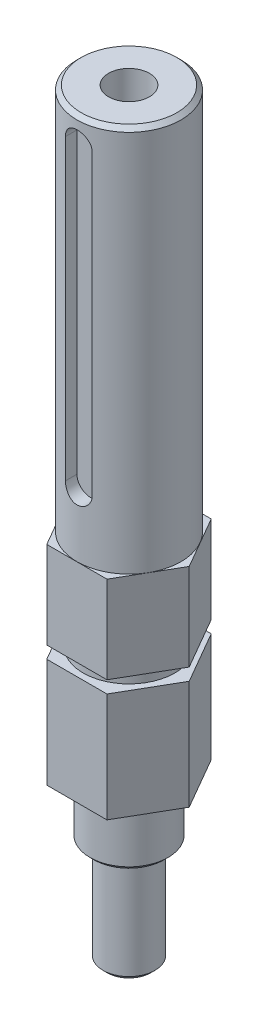
ISO-10303-21;
HEADER;
FILE_DESCRIPTION(('STEP AP214'),'2;1');
FILE_NAME('part.step','',(''),(''),'','','');
FILE_SCHEMA(('AUTOMOTIVE_DESIGN { 1 0 10303 214 1 1 1 1 }'));
ENDSEC;
DATA;
#1=APPLICATION_CONTEXT('core data for automotive mechanical design processes');
#2=APPLICATION_PROTOCOL_DEFINITION('international standard','automotive_design',2000,#1);
#3=PRODUCT_CONTEXT('',#1,'mechanical');
#4=PRODUCT('Part','Part','',(#3));
#5=PRODUCT_RELATED_PRODUCT_CATEGORY('part','',(#4));
#6=PRODUCT_DEFINITION_FORMATION('','',#4);
#7=PRODUCT_DEFINITION_CONTEXT('part definition',#1,'design');
#8=PRODUCT_DEFINITION('design','',#6,#7);
#9=PRODUCT_DEFINITION_SHAPE('','',#8);
#10=(LENGTH_UNIT() NAMED_UNIT(*) SI_UNIT(.MILLI.,.METRE.));
#11=(NAMED_UNIT(*) PLANE_ANGLE_UNIT() SI_UNIT($,.RADIAN.));
#12=(NAMED_UNIT(*) SI_UNIT($,.STERADIAN.) SOLID_ANGLE_UNIT());
#13=UNCERTAINTY_MEASURE_WITH_UNIT(LENGTH_MEASURE(1.E-05),#10,'distance_accuracy_value','');
#14=(GEOMETRIC_REPRESENTATION_CONTEXT(3) GLOBAL_UNCERTAINTY_ASSIGNED_CONTEXT((#13)) GLOBAL_UNIT_ASSIGNED_CONTEXT((#10,
#11,#12)) REPRESENTATION_CONTEXT('',''));
#15=CARTESIAN_POINT('',(0.,0.,0.));
#16=DIRECTION('',(0.,0.,1.));
#17=DIRECTION('',(1.,0.,0.));
#18=AXIS2_PLACEMENT_3D('',#15,#16,#17);
#19=CARTESIAN_POINT('',(-38.3071337234,29.7471008308,-16.6690116454));
#20=DIRECTION('',(0.,1.,0.));
#21=DIRECTION('',(-1.,0.,0.));
#22=AXIS2_PLACEMENT_3D('',#19,#20,#21);
#23=CONICAL_SURFACE('',#22,0.,1.02974425592936);
#24=CARTESIAN_POINT('',(-38.3071337234,29.7471008308,-16.6690116454));
#25=VERTEX_POINT('',#24);
#26=VERTEX_LOOP('',#25);
#27=FACE_BOUND('',#26,.T.);
#28=CARTESIAN_POINT('',(-38.3071337234,31.242,-16.6690116454));
#29=DIRECTION('',(0.,-1.,0.));
#30=DIRECTION('',(0.,0.,-1.));
#31=AXIS2_PLACEMENT_3D('',#28,#29,#30);
#32=CIRCLE('',#31,2.48793);
#33=CARTESIAN_POINT('',(-38.3071337234,31.242,-19.1569416454));
#34=VERTEX_POINT('',#33);
#35=EDGE_CURVE('E169',#34,#34,#32,.F.);
#36=ORIENTED_EDGE('',*,*,#35,.T.);
#37=EDGE_LOOP('',(#36));
#38=FACE_BOUND('',#37,.T.);
#39=ADVANCED_FACE('F17',(#27,#38),#23,.F.);
#40=CARTESIAN_POINT('',(-38.3071337234,47.117,-16.6690116454));
#41=DIRECTION('',(0.,-1.,0.));
#42=DIRECTION('',(1.,0.,0.));
#43=AXIS2_PLACEMENT_3D('',#40,#41,#42);
#44=CYLINDRICAL_SURFACE('',#43,2.48793);
#45=CARTESIAN_POINT('',(-38.3071337234,47.117,-16.6690116454));
#46=DIRECTION('',(0.,-1.,0.));
#47=DIRECTION('',(1.,0.,0.));
#48=AXIS2_PLACEMENT_3D('',#45,#46,#47);
#49=CIRCLE('',#48,2.48793);
#50=CARTESIAN_POINT('',(-35.8192037234,47.117,-16.6690116454));
#51=VERTEX_POINT('',#50);
#52=EDGE_CURVE('E20',#51,#51,#49,.F.);
#53=ORIENTED_EDGE('',*,*,#52,.T.);
#54=EDGE_LOOP('',(#53));
#55=FACE_BOUND('',#54,.T.);
#56=ORIENTED_EDGE('',*,*,#35,.F.);
#57=EDGE_LOOP('',(#56));
#58=FACE_BOUND('',#57,.T.);
#59=ADVANCED_FACE('F232',(#55,#58),#44,.F.);
#60=CARTESIAN_POINT('',(0.,0.,-11.9446116462606));
#61=DIRECTION('',(0.,0.,-1.));
#62=DIRECTION('',(-1.,0.,0.));
#63=AXIS2_PLACEMENT_3D('',#60,#61,#62);
#64=PLANE('',#63);
#65=DIRECTION('',(0.,1.,0.));
#66=VECTOR('',#65,1.);
#67=CARTESIAN_POINT('',(-36.6688337139455,0.,-11.9446116454));
#68=LINE('',#67,#66);
#69=CARTESIAN_POINT('',(-36.6688337186727,7.62,-11.9446116454));
#70=VERTEX_POINT('',#69);
#71=CARTESIAN_POINT('',(-36.6688337186727,43.942,-11.9446116454));
#72=VERTEX_POINT('',#71);
#73=EDGE_CURVE('E131',#70,#72,#68,.T.);
#74=ORIENTED_EDGE('',*,*,#73,.T.);
#75=CARTESIAN_POINT('',(-38.2944337234,43.942,-11.9446116454));
#76=DIRECTION('',(0.,0.,-1.));
#77=DIRECTION('',(-1.,0.,0.));
#78=AXIS2_PLACEMENT_3D('',#75,#76,#77);
#79=CIRCLE('',#78,1.6256);
#80=CARTESIAN_POINT('',(-39.9200337147713,43.942,-11.9446116454));
#81=VERTEX_POINT('',#80);
#82=EDGE_CURVE('E133',#72,#81,#79,.F.);
#83=ORIENTED_EDGE('',*,*,#82,.T.);
#84=DIRECTION('',(0.,1.,0.));
#85=VECTOR('',#84,1.);
#86=CARTESIAN_POINT('',(-39.9200337147713,0.,-11.9446116454));
#87=LINE('',#86,#85);
#88=CARTESIAN_POINT('',(-39.9200337190856,7.62,-11.9446116454));
#89=VERTEX_POINT('',#88);
#90=EDGE_CURVE('E136',#81,#89,#87,.F.);
#91=ORIENTED_EDGE('',*,*,#90,.T.);
#92=CARTESIAN_POINT('',(-38.2944337234,7.62,-11.9446116454));
#93=DIRECTION('',(0.,0.,-1.));
#94=DIRECTION('',(-1.,0.,0.));
#95=AXIS2_PLACEMENT_3D('',#92,#93,#94);
#96=CIRCLE('',#95,1.6256);
#97=EDGE_CURVE('E167',#89,#70,#96,.F.);
#98=ORIENTED_EDGE('',*,*,#97,.T.);
#99=EDGE_LOOP('',(#74,#83,#91,#98));
#100=FACE_BOUND('',#99,.T.);
#101=ADVANCED_FACE('F135',(#100),#64,.F.);
#102=CARTESIAN_POINT('',(0.,47.1169999982581,0.));
#103=DIRECTION('',(0.,1.,0.));
#104=DIRECTION('',(0.,0.,1.));
#105=AXIS2_PLACEMENT_3D('',#102,#103,#104);
#106=PLANE('',#105);
#107=ORIENTED_EDGE('',*,*,#52,.F.);
#108=EDGE_LOOP('',(#107));
#109=FACE_BOUND('',#108,.T.);
#110=CARTESIAN_POINT('',(-38.3071337234,47.117,-16.6690116454));
#111=DIRECTION('',(0.,-1.,0.));
#112=DIRECTION('',(1.,0.,0.));
#113=AXIS2_PLACEMENT_3D('',#110,#111,#112);
#114=CIRCLE('',#113,5.8293);
#115=CARTESIAN_POINT('',(-32.4778337234,47.117,-16.6690116454));
#116=VERTEX_POINT('',#115);
#117=EDGE_CURVE('E163',#116,#116,#114,.F.);
#118=ORIENTED_EDGE('',*,*,#117,.T.);
#119=EDGE_LOOP('',(#118));
#120=FACE_BOUND('',#119,.T.);
#121=ADVANCED_FACE('F226',(#109,#120),#106,.T.);
#122=CARTESIAN_POINT('',(-36.6688337139455,0.,0.));
#123=DIRECTION('',(1.,0.,0.));
#124=DIRECTION('',(0.,0.,-1.));
#125=AXIS2_PLACEMENT_3D('',#122,#123,#124);
#126=PLANE('',#125);
#127=ORIENTED_EDGE('',*,*,#73,.F.);
#128=DIRECTION('',(0.,0.,-1.));
#129=VECTOR('',#128,1.);
#130=CARTESIAN_POINT('',(-36.6688337234,7.62,-11.13470463047));
#131=LINE('',#130,#129);
#132=CARTESIAN_POINT('',(-36.6688337231593,7.62,-10.547137389977));
#133=VERTEX_POINT('',#132);
#134=EDGE_CURVE('E164',#70,#133,#131,.F.);
#135=ORIENTED_EDGE('',*,*,#134,.T.);
#136=DIRECTION('',(0.,1.,0.));
#137=VECTOR('',#136,1.);
#138=CARTESIAN_POINT('',(-36.6688337229187,23.3044999997243,-10.5471373900414));
#139=LINE('',#138,#137);
#140=CARTESIAN_POINT('',(-36.6688337232797,43.942,-10.547137389977));
#141=VERTEX_POINT('',#140);
#142=EDGE_CURVE('E160',#133,#141,#139,.T.);
#143=ORIENTED_EDGE('',*,*,#142,.T.);
#144=DIRECTION('',(0.,0.,1.));
#145=VECTOR('',#144,1.);
#146=CARTESIAN_POINT('',(-36.6688337234,43.942,-11.13726408306));
#147=LINE('',#146,#145);
#148=EDGE_CURVE('E143',#141,#72,#147,.F.);
#149=ORIENTED_EDGE('',*,*,#148,.T.);
#150=EDGE_LOOP('',(#127,#135,#143,#149));
#151=FACE_BOUND('',#150,.T.);
#152=ADVANCED_FACE('F223',(#151),#126,.F.);
#153=CARTESIAN_POINT('',(-38.2944337234,43.942,-10.32991652072));
#154=DIRECTION('',(0.,0.,-1.));
#155=DIRECTION('',(-1.,0.,0.));
#156=AXIS2_PLACEMENT_3D('',#153,#154,#155);
#157=CYLINDRICAL_SURFACE('',#156,1.6256);
#158=ORIENTED_EDGE('',*,*,#82,.F.);
#159=ORIENTED_EDGE('',*,*,#148,.F.);
#160=CARTESIAN_POINT('',(-36.6688337234194,43.942,-10.5471373899274));
#161=CARTESIAN_POINT('',(-36.6688331173559,43.9869132230824,-10.547140517418));
#162=CARTESIAN_POINT('',(-36.6706962528814,44.0318041382568,-10.5466386378901));
#163=CARTESIAN_POINT('',(-36.6781230875761,44.1212492173034,-10.5446571785954));
#164=CARTESIAN_POINT('',(-36.6836861333578,44.1658034392294,-10.5431777714557));
#165=CARTESIAN_POINT('',(-36.7058421910156,44.2982863146673,-10.5373329327794));
#166=CARTESIAN_POINT('',(-36.7279024963413,44.3853029336759,-10.5315605066644));
#167=CARTESIAN_POINT('',(-36.7858817424652,44.5542370706868,-10.5169351675073));
#168=CARTESIAN_POINT('',(-36.8217990686848,44.6361551814611,-10.5080826133642));
#169=CARTESIAN_POINT('',(-36.9064250978287,44.7928436735645,-10.4882941365168));
#170=CARTESIAN_POINT('',(-36.9551372097855,44.867612142696,-10.4773576587871));
#171=CARTESIAN_POINT('',(-37.0651738517186,45.0095820479997,-10.4543415813472));
#172=CARTESIAN_POINT('',(-37.126741428698,45.076591939617,-10.4422428205371));
#173=CARTESIAN_POINT('',(-37.2602380553349,45.1994763787339,-10.4184140217307));
#174=CARTESIAN_POINT('',(-37.3321706492424,45.2553471016266,-10.4066841115386));
#175=CARTESIAN_POINT('',(-37.4857159674889,45.3551763939344,-10.3846861458513));
#176=CARTESIAN_POINT('',(-37.5674620930751,45.3989357266696,-10.3744437245005));
#177=CARTESIAN_POINT('',(-37.7374052114194,45.4719765769247,-10.3567974034995));
#178=CARTESIAN_POINT('',(-37.8255948382402,45.501274337986,-10.3493903212467));
#179=CARTESIAN_POINT('',(-37.9796470482116,45.538188823147,-10.3398530504953));
#180=CARTESIAN_POINT('',(-38.0445631663894,45.5496298469016,-10.3368153435175));
#181=CARTESIAN_POINT('',(-38.175366207094,45.5645692395449,-10.3327438476344));
#182=CARTESIAN_POINT('',(-38.2412531066985,45.5680677956719,-10.3317100114894));
#183=CARTESIAN_POINT('',(-38.3968632247955,45.5668456823664,-10.3317138707887));
#184=CARTESIAN_POINT('',(-38.4865810710791,45.5586911719247,-10.3336369430375));
#185=CARTESIAN_POINT('',(-38.663343997131,45.5277322551274,-10.3411104639902));
#186=CARTESIAN_POINT('',(-38.7503866712589,45.5049150452558,-10.3466640829726));
#187=CARTESIAN_POINT('',(-38.9191932627246,45.4454120700701,-10.3607693277049));
#188=CARTESIAN_POINT('',(-39.0009642962698,45.4087454793147,-10.3693168072516));
#189=CARTESIAN_POINT('',(-39.1571958623636,45.3226431180772,-10.3884886613185));
#190=CARTESIAN_POINT('',(-39.2316564338337,45.2732074155839,-10.3991130247802));
#191=CARTESIAN_POINT('',(-39.372762747103,45.1618424885016,-10.4215310132768));
#192=CARTESIAN_POINT('',(-39.4392291699007,45.0996898042315,-10.4333433012731));
#193=CARTESIAN_POINT('',(-39.5609194002448,44.9651414098663,-10.4566658334685));
#194=CARTESIAN_POINT('',(-39.6161412925491,44.8927439583687,-10.4681760259222));
#195=CARTESIAN_POINT('',(-39.7145841132475,44.7384018165983,-10.4897688249227));
#196=CARTESIAN_POINT('',(-39.7576071086709,44.6563272570381,-10.4998267140666));
#197=CARTESIAN_POINT('',(-39.8291494859297,44.4858309684898,-10.5170848813646));
#198=CARTESIAN_POINT('',(-39.8576806278726,44.3974144527001,-10.524287475539));
#199=CARTESIAN_POINT('',(-39.8922738555966,44.2473749206176,-10.5331412325644));
#200=CARTESIAN_POINT('',(-39.9026692188615,44.186778719604,-10.5358455499993));
#201=CARTESIAN_POINT('',(-39.9165523690499,44.0647992337828,-10.539480069641));
#202=CARTESIAN_POINT('',(-39.9200458220733,44.0034166362711,-10.5404117270837));
#203=CARTESIAN_POINT('',(-39.9200337234,43.942,-10.5403963956066));
#204=B_SPLINE_CURVE_WITH_KNOTS('',3,(#160,#161,#162,#163,#164,#165,#166,#167,#168,#169,#170,
#171,#172,#173,#174,#175,#176,#177,#178,#179,#180,#181,#182,#183,#184,#185,#186,#187,#188,#189,
#190,#191,#192,#193,#194,#195,#196,#197,#198,#199,#200,#201,#202,#203),.UNSPECIFIED.,.F.,.F.,(4,
2,2,2,2,2,2,2,2,2,2,2,2,2,2,2,2,2,2,2,2,4),(0.,0.134654383448392,0.269284993846275,
0.53775345421134,0.80619064287798,1.0746994264121,1.34883846582806,1.623071468742,
1.9015786983701,2.17977238690593,2.37724591456429,2.57471478687525,2.84366769523774,
3.11285577385061,3.38167251784997,3.65048783056947,3.92451030631548,4.19857941639574,
4.47686962487167,4.75493363919668,4.93916434492229,5.12324374412517),.UNSPECIFIED.);
#205=CARTESIAN_POINT('',(-39.9200337192497,43.942,-10.5403963945144));
#206=VERTEX_POINT('',#205);
#207=EDGE_CURVE('E153',#141,#206,#204,.T.);
#208=ORIENTED_EDGE('',*,*,#207,.T.);
#209=DIRECTION('',(0.,0.,1.));
#210=VECTOR('',#209,1.);
#211=CARTESIAN_POINT('',(-39.9200337147713,43.942,0.));
#212=LINE('',#211,#210);
#213=EDGE_CURVE('E142',#206,#81,#212,.F.);
#214=ORIENTED_EDGE('',*,*,#213,.T.);
#215=EDGE_LOOP('',(#158,#159,#208,#214));
#216=FACE_BOUND('',#215,.T.);
#217=ADVANCED_FACE('F152',(#216),#157,.F.);
#218=CARTESIAN_POINT('',(-39.9200337147713,0.,0.));
#219=DIRECTION('',(-1.,0.,0.));
#220=DIRECTION('',(0.,0.,1.));
#221=AXIS2_PLACEMENT_3D('',#218,#219,#220);
#222=PLANE('',#221);
#223=ORIENTED_EDGE('',*,*,#90,.F.);
#224=ORIENTED_EDGE('',*,*,#213,.F.);
#225=DIRECTION('',(0.,-1.,0.));
#226=VECTOR('',#225,1.);
#227=CARTESIAN_POINT('',(-39.9200337237282,23.3044999997243,-10.540396395693));
#228=LINE('',#227,#226);
#229=CARTESIAN_POINT('',(-39.920033723482,7.62,-10.5403963956498));
#230=VERTEX_POINT('',#229);
#231=EDGE_CURVE('E157',#206,#230,#228,.T.);
#232=ORIENTED_EDGE('',*,*,#231,.T.);
#233=DIRECTION('',(0.,0.,1.));
#234=VECTOR('',#233,1.);
#235=CARTESIAN_POINT('',(-39.9200337234,7.62,-11.13470463047));
#236=LINE('',#235,#234);
#237=EDGE_CURVE('E149',#230,#89,#236,.F.);
#238=ORIENTED_EDGE('',*,*,#237,.T.);
#239=EDGE_LOOP('',(#223,#224,#232,#238));
#240=FACE_BOUND('',#239,.T.);
#241=ADVANCED_FACE('F146',(#240),#222,.F.);
#242=CARTESIAN_POINT('',(-38.2944337234,7.62,-10.32479761554));
#243=DIRECTION('',(0.,0.,-1.));
#244=DIRECTION('',(-1.,0.,0.));
#245=AXIS2_PLACEMENT_3D('',#242,#243,#244);
#246=CYLINDRICAL_SURFACE('',#245,1.6256);
#247=ORIENTED_EDGE('',*,*,#97,.F.);
#248=ORIENTED_EDGE('',*,*,#237,.F.);
#249=CARTESIAN_POINT('',(-39.9200337233858,7.62,-10.5403963956176));
#250=CARTESIAN_POINT('',(-39.9200343027389,7.57505716408372,-10.5403995109041));
#251=CARTESIAN_POINT('',(-39.9181687382391,7.5301366299133,-10.5399052645826));
#252=CARTESIAN_POINT('',(-39.9107320376266,7.44063211986704,-10.5379541722975));
#253=CARTESIAN_POINT('',(-39.90516154366,7.39604808702213,-10.5364974931452));
#254=CARTESIAN_POINT('',(-39.8829748012874,7.26347234177431,-10.5307428758463));
#255=CARTESIAN_POINT('',(-39.8608829271479,7.17639263153677,-10.5250599881469));
#256=CARTESIAN_POINT('',(-39.8028156693581,7.00733333292107,-10.5106686050908));
#257=CARTESIAN_POINT('',(-39.7668416560501,6.92535324207329,-10.5019604083787));
#258=CARTESIAN_POINT('',(-39.6820765888974,6.76855139505806,-10.4825111660349));
#259=CARTESIAN_POINT('',(-39.6332823592317,6.6937314188665,-10.4717696168862));
#260=CARTESIAN_POINT('',(-39.5230890235054,6.55171892478943,-10.4492011374638));
#261=CARTESIAN_POINT('',(-39.4614535617753,6.48471266381142,-10.4373565647526));
#262=CARTESIAN_POINT('',(-39.3278117109779,6.3618482106432,-10.414079137073));
#263=CARTESIAN_POINT('',(-39.2558014693683,6.30599417815495,-10.4026464370283));
#264=CARTESIAN_POINT('',(-39.102169511402,6.20626390714197,-10.3812944786169));
#265=CARTESIAN_POINT('',(-39.0204220511849,6.16257584053741,-10.3713999422531));
#266=CARTESIAN_POINT('',(-38.8505070948641,6.08967931033348,-10.3544749739849));
#267=CARTESIAN_POINT('',(-38.7623479754394,6.06045233002869,-10.3474408814913));
#268=CARTESIAN_POINT('',(-38.6125889857612,6.02465318656142,-10.3387931989957));
#269=CARTESIAN_POINT('',(-38.5520450794807,6.01376614388771,-10.3361518728947));
#270=CARTESIAN_POINT('',(-38.4300631321595,5.99890320356431,-10.3326102582362));
#271=CARTESIAN_POINT('',(-38.3686251007001,5.99492723191277,-10.3317099510363));
#272=CARTESIAN_POINT('',(-38.2174572045331,5.99375306599012,-10.331714116391));
#273=CARTESIAN_POINT('',(-38.1276672291049,6.00049685328776,-10.3336349748622));
#274=CARTESIAN_POINT('',(-37.9505200722018,6.02866100542893,-10.3411303116834));
#275=CARTESIAN_POINT('',(-37.8631654614231,6.05009630998462,-10.3467085089077));
#276=CARTESIAN_POINT('',(-37.6935203490939,6.10690149564915,-10.3609146991124));
#277=CARTESIAN_POINT('',(-37.611222771011,6.14225136726778,-10.3695383108886));
#278=CARTESIAN_POINT('',(-37.4537383131801,6.22581359902913,-10.3889327241843));
#279=CARTESIAN_POINT('',(-37.3785512227097,6.27402557783574,-10.3997034620433));
#280=CARTESIAN_POINT('',(-37.2357850276218,6.3830437277691,-10.4224993385844));
#281=CARTESIAN_POINT('',(-37.1683821300026,6.4440764016433,-10.4345447839602));
#282=CARTESIAN_POINT('',(-37.0446421659605,6.57653837651597,-10.4584185835418));
#283=CARTESIAN_POINT('',(-36.9883068903511,6.64796935677843,-10.4702469023347));
#284=CARTESIAN_POINT('',(-36.8873974787592,6.80064853891512,-10.4925689777037));
#285=CARTESIAN_POINT('',(-36.8430345867707,6.88204028811097,-10.503037259633));
#286=CARTESIAN_POINT('',(-36.7687106331166,7.0514205033058,-10.5211586235514));
#287=CARTESIAN_POINT('',(-36.7387391568963,7.13940414552119,-10.5288137403836));
#288=CARTESIAN_POINT('',(-36.7006780536368,7.29313763533453,-10.5386818176718));
#289=CARTESIAN_POINT('',(-36.6887585130561,7.35790494935085,-10.5418302716095));
#290=CARTESIAN_POINT('',(-36.6728292663508,7.48843609244857,-10.5460681139886));
#291=CARTESIAN_POINT('',(-36.6688155270224,7.55419939615339,-10.5471585523304));
#292=CARTESIAN_POINT('',(-36.6688337234,7.61999999997463,-10.5471373899126));
#293=B_SPLINE_CURVE_WITH_KNOTS('',3,(#249,#250,#251,#252,#253,#254,#255,#256,#257,#258,#259,
#260,#261,#262,#263,#264,#265,#266,#267,#268,#269,#270,#271,#272,#273,#274,#275,#276,#277,#278,
#279,#280,#281,#282,#283,#284,#285,#286,#287,#288,#289,#290,#291,#292),.UNSPECIFIED.,.F.,.F.,(4,
2,2,2,2,2,2,2,2,2,2,2,2,2,2,2,2,2,2,2,2,4),(0.,0.134743234090036,0.269463120285456,
0.538120205092799,0.806750776834311,1.07544795652383,1.34961447058744,1.62388305655983,
1.90218397172397,2.18012760813987,2.36445257689152,2.5487755719299,2.8175847166687,
3.08666761810411,3.35536497709605,3.62405437062664,3.89796436932799,4.17191865202263,
4.45043032810088,4.72874015030962,4.9260423662726,5.12324390093237),.UNSPECIFIED.);
#294=EDGE_CURVE('E197',#230,#133,#293,.T.);
#295=ORIENTED_EDGE('',*,*,#294,.T.);
#296=ORIENTED_EDGE('',*,*,#134,.F.);
#297=EDGE_LOOP('',(#247,#248,#295,#296));
#298=FACE_BOUND('',#297,.T.);
#299=ADVANCED_FACE('F213',(#298),#246,.F.);
#300=CARTESIAN_POINT('',(-38.3071337234,47.117,-16.6690116454));
#301=DIRECTION('',(0.,-1.,0.));
#302=DIRECTION('',(1.,0.,0.));
#303=AXIS2_PLACEMENT_3D('',#300,#301,#302);
#304=CONICAL_SURFACE('',#303,5.8293,0.785398163397447);
#305=ORIENTED_EDGE('',*,*,#117,.F.);
#306=EDGE_LOOP('',(#305));
#307=FACE_BOUND('',#306,.T.);
#308=CARTESIAN_POINT('',(-38.3071337234,46.609,-16.6690116454));
#309=DIRECTION('',(0.,-1.,0.));
#310=DIRECTION('',(0.,0.,1.));
#311=AXIS2_PLACEMENT_3D('',#308,#309,#310);
#312=CIRCLE('',#311,6.3373);
#313=CARTESIAN_POINT('',(-38.3071337234,46.609,-10.3317116454));
#314=VERTEX_POINT('',#313);
#315=EDGE_CURVE('E196',#314,#314,#312,.F.);
#316=ORIENTED_EDGE('',*,*,#315,.T.);
#317=EDGE_LOOP('',(#316));
#318=FACE_BOUND('',#317,.T.);
#319=ADVANCED_FACE('F217',(#307,#318),#304,.T.);
#320=CARTESIAN_POINT('',(-38.3071337234,46.609,-16.6690116454));
#321=DIRECTION('',(0.,-1.,0.));
#322=DIRECTION('',(0.,0.,-1.));
#323=AXIS2_PLACEMENT_3D('',#320,#321,#322);
#324=CYLINDRICAL_SURFACE('',#323,6.3373);
#325=CARTESIAN_POINT('',(-38.3071337234,0.,-16.6690116454));
#326=DIRECTION('',(0.,-1.,0.));
#327=DIRECTION('',(0.,0.,-1.));
#328=AXIS2_PLACEMENT_3D('',#325,#326,#327);
#329=CIRCLE('',#328,6.3373);
#330=CARTESIAN_POINT('',(-38.3071337234,0.,-23.0063116454));
#331=VERTEX_POINT('',#330);
#332=EDGE_CURVE('E192',#331,#331,#329,.F.);
#333=ORIENTED_EDGE('',*,*,#332,.T.);
#334=EDGE_LOOP('',(#333));
#335=FACE_BOUND('',#334,.T.);
#336=ORIENTED_EDGE('',*,*,#315,.F.);
#337=EDGE_LOOP('',(#336));
#338=FACE_BOUND('',#337,.T.);
#339=ORIENTED_EDGE('',*,*,#142,.F.);
#340=ORIENTED_EDGE('',*,*,#294,.F.);
#341=ORIENTED_EDGE('',*,*,#231,.F.);
#342=ORIENTED_EDGE('',*,*,#207,.F.);
#343=EDGE_LOOP('',(#339,#340,#341,#342));
#344=FACE_BOUND('',#343,.T.);
#345=ADVANCED_FACE('F209',(#335,#338,#344),#324,.T.);
#346=CARTESIAN_POINT('',(0.,0.,0.));
#347=DIRECTION('',(0.,-1.,0.));
#348=DIRECTION('',(0.,0.,-1.));
#349=AXIS2_PLACEMENT_3D('',#346,#347,#348);
#350=PLANE('',#349);
#351=ORIENTED_EDGE('',*,*,#332,.F.);
#352=EDGE_LOOP('',(#351));
#353=FACE_BOUND('',#352,.T.);
#354=DIRECTION('',(0.499999999976173,0.,-0.866025403798195));
#355=VECTOR('',#354,1.);
#356=CARTESIAN_POINT('',(-30.4489827407465,0.,-17.5797283808033));
#357=LINE('',#356,#355);
#358=CARTESIAN_POINT('',(-34.6409594973203,0.,-10.3190116461587));
#359=VERTEX_POINT('',#358);
#360=CARTESIAN_POINT('',(-30.9747852942441,0.,-16.669011644907));
#361=VERTEX_POINT('',#360);
#362=EDGE_CURVE('E195',#359,#361,#357,.T.);
#363=ORIENTED_EDGE('',*,*,#362,.T.);
#364=DIRECTION('',(-0.499999999976173,0.,-0.866025403798195));
#365=VECTOR('',#364,1.);
#366=CARTESIAN_POINT('',(-16.0131952027159,0.,9.24522256028665));
#367=LINE('',#366,#365);
#368=CARTESIAN_POINT('',(-34.6409594996435,0.,-23.0190116435238));
#369=VERTEX_POINT('',#368);
#370=EDGE_CURVE('E344',#361,#369,#367,.T.);
#371=ORIENTED_EDGE('',*,*,#370,.T.);
#372=DIRECTION('',(-1.,0.,0.));
#373=VECTOR('',#372,1.);
#374=CARTESIAN_POINT('',(0.,0.,-23.0190116458477));
#375=LINE('',#374,#373);
#376=CARTESIAN_POINT('',(-41.9733079243032,0.,-23.0190116451061));
#377=VERTEX_POINT('',#376);
#378=EDGE_CURVE('E577',#369,#377,#375,.T.);
#379=ORIENTED_EDGE('',*,*,#378,.T.);
#380=DIRECTION('',(-0.499999999976173,0.,0.866025403798195));
#381=VECTOR('',#380,1.);
#382=CARTESIAN_POINT('',(-41.4475053684594,0.,-23.929728380198));
#383=LINE('',#382,#381);
#384=CARTESIAN_POINT('',(-45.6394821290293,0.,-16.6690116453275));
#385=VERTEX_POINT('',#384);
#386=EDGE_CURVE('E582',#377,#385,#383,.T.);
#387=ORIENTED_EDGE('',*,*,#386,.T.);
#388=DIRECTION('',(0.499999999976173,0.,0.866025403798195));
#389=VECTOR('',#388,1.);
#390=CARTESIAN_POINT('',(-27.0117178304289,0.,15.5952225596814));
#391=LINE('',#390,#389);
#392=CARTESIAN_POINT('',(-41.9733079246094,0.,-10.3190116458529));
#393=VERTEX_POINT('',#392);
#394=EDGE_CURVE('E587',#385,#393,#391,.T.);
#395=ORIENTED_EDGE('',*,*,#394,.T.);
#396=DIRECTION('',(1.,0.,0.));
#397=VECTOR('',#396,1.);
#398=CARTESIAN_POINT('',(0.,0.,-10.3190116458477));
#399=LINE('',#398,#397);
#400=EDGE_CURVE('E347',#393,#359,#399,.T.);
#401=ORIENTED_EDGE('',*,*,#400,.T.);
#402=EDGE_LOOP('',(#363,#371,#379,#387,#395,#401));
#403=FACE_BOUND('',#402,.T.);
#404=ADVANCED_FACE('F332',(#353,#403),#350,.F.);
#405=CARTESIAN_POINT('',(-30.4489827407465,0.,-17.5797283808033));
#406=DIRECTION('',(0.866025403798195,0.,0.499999999976173));
#407=DIRECTION('',(0.499999999976173,0.,-0.866025403798195));
#408=AXIS2_PLACEMENT_3D('',#405,#406,#407);
#409=PLANE('',#408);
#410=DIRECTION('',(0.,1.,0.));
#411=VECTOR('',#410,1.);
#412=CARTESIAN_POINT('',(-30.9747852957961,0.,-16.6690116445939));
#413=LINE('',#412,#411);
#414=CARTESIAN_POINT('',(-30.9747852942441,-10.6171999994645,-16.669011644907));
#415=VERTEX_POINT('',#414);
#416=EDGE_CURVE('E351',#415,#361,#413,.T.);
#417=ORIENTED_EDGE('',*,*,#416,.T.);
#418=ORIENTED_EDGE('',*,*,#362,.F.);
#419=DIRECTION('',(0.,1.,0.));
#420=VECTOR('',#419,1.);
#421=CARTESIAN_POINT('',(-34.6409594962,0.,-10.3190116458477));
#422=LINE('',#421,#420);
#423=CARTESIAN_POINT('',(-34.6409594984406,-10.6171999994645,-10.3190116468055));
#424=VERTEX_POINT('',#423);
#425=EDGE_CURVE('E593',#359,#424,#422,.F.);
#426=ORIENTED_EDGE('',*,*,#425,.T.);
#427=DIRECTION('',(0.499999999227316,0.,-0.866025404230548));
#428=VECTOR('',#427,1.);
#429=CARTESIAN_POINT('',(-34.6409594962,-10.6171999978581,-10.3190116454));
#430=LINE('',#429,#428);
#431=EDGE_CURVE('E359',#424,#415,#430,.T.);
#432=ORIENTED_EDGE('',*,*,#431,.T.);
#433=EDGE_LOOP('',(#417,#418,#426,#432));
#434=FACE_BOUND('',#433,.T.);
#435=ADVANCED_FACE('F329',(#434),#409,.T.);
#436=CARTESIAN_POINT('',(-16.0131952027159,0.,9.24522256028665));
#437=DIRECTION('',(0.866025403798195,0.,-0.499999999976173));
#438=DIRECTION('',(-0.499999999976173,0.,-0.866025403798195));
#439=AXIS2_PLACEMENT_3D('',#436,#437,#438);
#440=PLANE('',#439);
#441=DIRECTION('',(0.,1.,0.));
#442=VECTOR('',#441,1.);
#443=CARTESIAN_POINT('',(-34.6409594962,0.,-23.0190116458477));
#444=LINE('',#443,#442);
#445=CARTESIAN_POINT('',(-34.6409594996435,-10.6171999994645,-23.0190116435238));
#446=VERTEX_POINT('',#445);
#447=EDGE_CURVE('E356',#446,#369,#444,.T.);
#448=ORIENTED_EDGE('',*,*,#447,.T.);
#449=ORIENTED_EDGE('',*,*,#370,.F.);
#450=ORIENTED_EDGE('',*,*,#416,.F.);
#451=DIRECTION('',(-0.499999999227316,0.,-0.866025404230548));
#452=VECTOR('',#451,1.);
#453=CARTESIAN_POINT('',(-30.9747852944,-10.6171999978581,-16.6690116454));
#454=LINE('',#453,#452);
#455=EDGE_CURVE('E596',#415,#446,#454,.T.);
#456=ORIENTED_EDGE('',*,*,#455,.T.);
#457=EDGE_LOOP('',(#448,#449,#450,#456));
#458=FACE_BOUND('',#457,.T.);
#459=ADVANCED_FACE('F325',(#458),#440,.T.);
#460=CARTESIAN_POINT('',(0.,0.,-23.0190116458477));
#461=DIRECTION('',(0.,0.,-1.));
#462=DIRECTION('',(-1.,0.,0.));
#463=AXIS2_PLACEMENT_3D('',#460,#461,#462);
#464=PLANE('',#463);
#465=DIRECTION('',(0.,1.,0.));
#466=VECTOR('',#465,1.);
#467=CARTESIAN_POINT('',(-41.9733079216129,0.,-23.019011643329));
#468=LINE('',#467,#466);
#469=CARTESIAN_POINT('',(-41.9733079243032,-10.6171999994645,-23.0190116451061));
#470=VERTEX_POINT('',#469);
#471=EDGE_CURVE('E579',#470,#377,#468,.T.);
#472=ORIENTED_EDGE('',*,*,#471,.T.);
#473=ORIENTED_EDGE('',*,*,#378,.F.);
#474=ORIENTED_EDGE('',*,*,#447,.F.);
#475=DIRECTION('',(1.,0.,0.));
#476=VECTOR('',#475,1.);
#477=CARTESIAN_POINT('',(0.,-10.6171999978581,-23.0190116454));
#478=LINE('',#477,#476);
#479=EDGE_CURVE('E598',#446,#470,#478,.F.);
#480=ORIENTED_EDGE('',*,*,#479,.T.);
#481=EDGE_LOOP('',(#472,#473,#474,#480));
#482=FACE_BOUND('',#481,.T.);
#483=ADVANCED_FACE('F321',(#482),#464,.T.);
#484=CARTESIAN_POINT('',(-41.4475053684594,0.,-23.929728380198));
#485=DIRECTION('',(-0.866025403798195,0.,-0.499999999976173));
#486=DIRECTION('',(-0.499999999976173,0.,0.866025403798195));
#487=AXIS2_PLACEMENT_3D('',#484,#485,#486);
#488=PLANE('',#487);
#489=DIRECTION('',(0.,1.,0.));
#490=VECTOR('',#489,1.);
#491=CARTESIAN_POINT('',(-45.6394821313097,0.,-16.6690116429118));
#492=LINE('',#491,#490);
#493=CARTESIAN_POINT('',(-45.6394821290293,-10.6171999994645,-16.6690116453275));
#494=VERTEX_POINT('',#493);
#495=EDGE_CURVE('E584',#494,#385,#492,.T.);
#496=ORIENTED_EDGE('',*,*,#495,.T.);
#497=ORIENTED_EDGE('',*,*,#386,.F.);
#498=ORIENTED_EDGE('',*,*,#471,.F.);
#499=DIRECTION('',(-0.499999999227316,0.,0.866025404230548));
#500=VECTOR('',#499,1.);
#501=CARTESIAN_POINT('',(-41.9733079252,-10.6171999978581,-23.0190116454));
#502=LINE('',#501,#500);
#503=EDGE_CURVE('E601',#470,#494,#502,.T.);
#504=ORIENTED_EDGE('',*,*,#503,.T.);
#505=EDGE_LOOP('',(#496,#497,#498,#504));
#506=FACE_BOUND('',#505,.T.);
#507=ADVANCED_FACE('F317',(#506),#488,.T.);
#508=CARTESIAN_POINT('',(-27.0117178304289,0.,15.5952225596814));
#509=DIRECTION('',(-0.866025403798195,0.,0.499999999976173));
#510=DIRECTION('',(0.499999999976173,0.,0.866025403798195));
#511=AXIS2_PLACEMENT_3D('',#508,#509,#510);
#512=PLANE('',#511);
#513=DIRECTION('',(0.,1.,0.));
#514=VECTOR('',#513,1.);
#515=CARTESIAN_POINT('',(-41.9733079252,0.,-10.3190116458477));
#516=LINE('',#515,#514);
#517=CARTESIAN_POINT('',(-41.9733079246094,-10.6171999994645,-10.3190116458529));
#518=VERTEX_POINT('',#517);
#519=EDGE_CURVE('E589',#518,#393,#516,.T.);
#520=ORIENTED_EDGE('',*,*,#519,.T.);
#521=ORIENTED_EDGE('',*,*,#394,.F.);
#522=ORIENTED_EDGE('',*,*,#495,.F.);
#523=DIRECTION('',(0.499999999227316,0.,0.866025404230548));
#524=VECTOR('',#523,1.);
#525=CARTESIAN_POINT('',(-45.639482127,-10.6171999978581,-16.6690116454));
#526=LINE('',#525,#524);
#527=EDGE_CURVE('E604',#494,#518,#526,.T.);
#528=ORIENTED_EDGE('',*,*,#527,.T.);
#529=EDGE_LOOP('',(#520,#521,#522,#528));
#530=FACE_BOUND('',#529,.T.);
#531=ADVANCED_FACE('F313',(#530),#512,.T.);
#532=CARTESIAN_POINT('',(0.,0.,-10.3190116458477));
#533=DIRECTION('',(0.,0.,1.));
#534=DIRECTION('',(1.,0.,0.));
#535=AXIS2_PLACEMENT_3D('',#532,#533,#534);
#536=PLANE('',#535);
#537=ORIENTED_EDGE('',*,*,#425,.F.);
#538=ORIENTED_EDGE('',*,*,#400,.F.);
#539=ORIENTED_EDGE('',*,*,#519,.F.);
#540=DIRECTION('',(1.,0.,0.));
#541=VECTOR('',#540,1.);
#542=CARTESIAN_POINT('',(0.,-10.6171999978581,-10.3190116454));
#543=LINE('',#542,#541);
#544=EDGE_CURVE('E191',#518,#424,#543,.T.);
#545=ORIENTED_EDGE('',*,*,#544,.T.);
#546=EDGE_LOOP('',(#537,#538,#539,#545));
#547=FACE_BOUND('',#546,.T.);
#548=ADVANCED_FACE('F309',(#547),#536,.T.);
#549=CARTESIAN_POINT('',(0.,-10.6171999978581,0.));
#550=DIRECTION('',(0.,-1.,0.));
#551=DIRECTION('',(0.,0.,-1.));
#552=AXIS2_PLACEMENT_3D('',#549,#550,#551);
#553=PLANE('',#552);
#554=CARTESIAN_POINT('',(-38.3071337234,-10.6172,-16.6690116454));
#555=DIRECTION('',(0.,-1.,0.));
#556=DIRECTION('',(0.,0.,-1.));
#557=AXIS2_PLACEMENT_3D('',#554,#555,#556);
#558=CIRCLE('',#557,5.588);
#559=CARTESIAN_POINT('',(-38.3071337234,-10.6172,-22.2570116454));
#560=VERTEX_POINT('',#559);
#561=EDGE_CURVE('E188',#560,#560,#558,.F.);
#562=ORIENTED_EDGE('',*,*,#561,.T.);
#563=EDGE_LOOP('',(#562));
#564=FACE_BOUND('',#563,.T.);
#565=ORIENTED_EDGE('',*,*,#527,.F.);
#566=ORIENTED_EDGE('',*,*,#503,.F.);
#567=ORIENTED_EDGE('',*,*,#479,.F.);
#568=ORIENTED_EDGE('',*,*,#455,.F.);
#569=ORIENTED_EDGE('',*,*,#431,.F.);
#570=ORIENTED_EDGE('',*,*,#544,.F.);
#571=EDGE_LOOP('',(#565,#566,#567,#568,#569,#570));
#572=FACE_BOUND('',#571,.T.);
#573=ADVANCED_FACE('F305',(#564,#572),#553,.T.);
#574=CARTESIAN_POINT('',(-38.3071337234,-10.6172,-16.6690116454));
#575=DIRECTION('',(0.,-1.,0.));
#576=DIRECTION('',(0.,0.,-1.));
#577=AXIS2_PLACEMENT_3D('',#574,#575,#576);
#578=CYLINDRICAL_SURFACE('',#577,5.588);
#579=ORIENTED_EDGE('',*,*,#561,.F.);
#580=EDGE_LOOP('',(#579));
#581=FACE_BOUND('',#580,.T.);
#582=CARTESIAN_POINT('',(-38.3071337234,-12.1158,-16.6690116454));
#583=DIRECTION('',(0.,-1.,0.));
#584=DIRECTION('',(0.,0.,-1.));
#585=AXIS2_PLACEMENT_3D('',#582,#583,#584);
#586=CIRCLE('',#585,5.588);
#587=CARTESIAN_POINT('',(-38.3071337234,-12.1158,-22.2570116454));
#588=VERTEX_POINT('',#587);
#589=EDGE_CURVE('E184',#588,#588,#586,.F.);
#590=ORIENTED_EDGE('',*,*,#589,.T.);
#591=EDGE_LOOP('',(#590));
#592=FACE_BOUND('',#591,.T.);
#593=ADVANCED_FACE('F301',(#581,#592),#578,.T.);
#594=CARTESIAN_POINT('',(0.,-12.1158000006581,0.));
#595=DIRECTION('',(0.,-1.,0.));
#596=DIRECTION('',(0.,0.,-1.));
#597=AXIS2_PLACEMENT_3D('',#594,#595,#596);
#598=PLANE('',#597);
#599=ORIENTED_EDGE('',*,*,#589,.F.);
#600=EDGE_LOOP('',(#599));
#601=FACE_BOUND('',#600,.T.);
#602=DIRECTION('',(0.499999999976173,0.,-0.866025403798195));
#603=VECTOR('',#602,1.);
#604=CARTESIAN_POINT('',(-30.4489827407465,-12.1158,-17.5797283808033));
#605=LINE('',#604,#603);
#606=CARTESIAN_POINT('',(-34.6409594973203,-12.115800000329,-10.3190116461587));
#607=VERTEX_POINT('',#606);
#608=CARTESIAN_POINT('',(-30.9747852942441,-12.1158000001645,-16.669011644907));
#609=VERTEX_POINT('',#608);
#610=EDGE_CURVE('E187',#607,#609,#605,.T.);
#611=ORIENTED_EDGE('',*,*,#610,.T.);
#612=DIRECTION('',(-0.499999999976173,0.,-0.866025403798195));
#613=VECTOR('',#612,1.);
#614=CARTESIAN_POINT('',(-16.0131952027159,-12.1158,9.24522256028665));
#615=LINE('',#614,#613);
#616=CARTESIAN_POINT('',(-34.6409594996435,-12.1158000001645,-23.0190116435238));
#617=VERTEX_POINT('',#616);
#618=EDGE_CURVE('E613',#609,#617,#615,.T.);
#619=ORIENTED_EDGE('',*,*,#618,.T.);
#620=DIRECTION('',(-1.,0.,0.));
#621=VECTOR('',#620,1.);
#622=CARTESIAN_POINT('',(0.,-12.1158,-23.0190116458477));
#623=LINE('',#622,#621);
#624=CARTESIAN_POINT('',(-41.9733079243032,-12.1158000001645,-23.0190116451061));
#625=VERTEX_POINT('',#624);
#626=EDGE_CURVE('E618',#617,#625,#623,.T.);
#627=ORIENTED_EDGE('',*,*,#626,.T.);
#628=DIRECTION('',(-0.499999999976173,0.,0.866025403798195));
#629=VECTOR('',#628,1.);
#630=CARTESIAN_POINT('',(-41.4475053684594,-12.1158,-23.929728380198));
#631=LINE('',#630,#629);
#632=CARTESIAN_POINT('',(-45.6394821290293,-12.1158000001645,-16.6690116453275));
#633=VERTEX_POINT('',#632);
#634=EDGE_CURVE('E623',#625,#633,#631,.T.);
#635=ORIENTED_EDGE('',*,*,#634,.T.);
#636=DIRECTION('',(0.499999999976173,0.,0.866025403798195));
#637=VECTOR('',#636,1.);
#638=CARTESIAN_POINT('',(-27.0117178304289,-12.1158,15.5952225596814));
#639=LINE('',#638,#637);
#640=CARTESIAN_POINT('',(-41.9733079246094,-12.1158000001645,-10.3190116458529));
#641=VERTEX_POINT('',#640);
#642=EDGE_CURVE('E628',#633,#641,#639,.T.);
#643=ORIENTED_EDGE('',*,*,#642,.T.);
#644=DIRECTION('',(1.,0.,0.));
#645=VECTOR('',#644,1.);
#646=CARTESIAN_POINT('',(0.,-12.1158,-10.3190116458477));
#647=LINE('',#646,#645);
#648=EDGE_CURVE('E631',#641,#607,#647,.T.);
#649=ORIENTED_EDGE('',*,*,#648,.T.);
#650=EDGE_LOOP('',(#611,#619,#627,#635,#643,#649));
#651=FACE_BOUND('',#650,.T.);
#652=ADVANCED_FACE('F297',(#601,#651),#598,.F.);
#653=CARTESIAN_POINT('',(0.,-45.2120000018064,0.));
#654=DIRECTION('',(0.,-1.,0.));
#655=DIRECTION('',(0.,0.,-1.));
#656=AXIS2_PLACEMENT_3D('',#653,#654,#655);
#657=PLANE('',#656);
#658=CARTESIAN_POINT('',(-38.3071337234,-45.212,-16.6690116454));
#659=DIRECTION('',(0.,1.,0.));
#660=DIRECTION('',(0.,0.,1.));
#661=AXIS2_PLACEMENT_3D('',#658,#659,#660);
#662=CIRCLE('',#661,2.6543);
#663=CARTESIAN_POINT('',(-38.3071337234,-45.212,-14.0147116454));
#664=VERTEX_POINT('',#663);
#665=EDGE_CURVE('E179',#664,#664,#662,.F.);
#666=ORIENTED_EDGE('',*,*,#665,.T.);
#667=EDGE_LOOP('',(#666));
#668=FACE_BOUND('',#667,.T.);
#669=ADVANCED_FACE('F293',(#668),#657,.T.);
#670=CARTESIAN_POINT('',(-30.4489827407465,0.,-17.5797283808033));
#671=DIRECTION('',(0.866025403798195,0.,0.499999999976173));
#672=DIRECTION('',(0.499999999976173,0.,-0.866025403798195));
#673=AXIS2_PLACEMENT_3D('',#670,#671,#672);
#674=PLANE('',#673);
#675=DIRECTION('',(0.,1.,0.));
#676=VECTOR('',#675,1.);
#677=CARTESIAN_POINT('',(-30.9747852957961,0.,-16.6690116445939));
#678=LINE('',#677,#676);
#679=CARTESIAN_POINT('',(-30.9747852942441,-25.4,-16.669011644907));
#680=VERTEX_POINT('',#679);
#681=EDGE_CURVE('E610',#680,#609,#678,.T.);
#682=ORIENTED_EDGE('',*,*,#681,.T.);
#683=ORIENTED_EDGE('',*,*,#610,.F.);
#684=DIRECTION('',(0.,1.,0.));
#685=VECTOR('',#684,1.);
#686=CARTESIAN_POINT('',(-34.6409594962,0.,-10.3190116458477));
#687=LINE('',#686,#685);
#688=CARTESIAN_POINT('',(-34.6409594984406,-25.4,-10.3190116468055));
#689=VERTEX_POINT('',#688);
#690=EDGE_CURVE('E183',#607,#689,#687,.F.);
#691=ORIENTED_EDGE('',*,*,#690,.T.);
#692=DIRECTION('',(0.499999999227316,0.,-0.866025404230548));
#693=VECTOR('',#692,1.);
#694=CARTESIAN_POINT('',(-34.6409594962,-25.4,-10.3190116454));
#695=LINE('',#694,#693);
#696=EDGE_CURVE('E182',#689,#680,#695,.T.);
#697=ORIENTED_EDGE('',*,*,#696,.T.);
#698=EDGE_LOOP('',(#682,#683,#691,#697));
#699=FACE_BOUND('',#698,.T.);
#700=ADVANCED_FACE('F289',(#699),#674,.T.);
#701=CARTESIAN_POINT('',(-16.0131952027159,0.,9.24522256028665));
#702=DIRECTION('',(0.866025403798195,0.,-0.499999999976173));
#703=DIRECTION('',(-0.499999999976173,0.,-0.866025403798195));
#704=AXIS2_PLACEMENT_3D('',#701,#702,#703);
#705=PLANE('',#704);
#706=DIRECTION('',(0.,1.,0.));
#707=VECTOR('',#706,1.);
#708=CARTESIAN_POINT('',(-34.6409594962,0.,-23.0190116458477));
#709=LINE('',#708,#707);
#710=CARTESIAN_POINT('',(-34.6409594996435,-25.4,-23.0190116435238));
#711=VERTEX_POINT('',#710);
#712=EDGE_CURVE('E615',#711,#617,#709,.T.);
#713=ORIENTED_EDGE('',*,*,#712,.T.);
#714=ORIENTED_EDGE('',*,*,#618,.F.);
#715=ORIENTED_EDGE('',*,*,#681,.F.);
#716=DIRECTION('',(-0.499999999227316,0.,-0.866025404230548));
#717=VECTOR('',#716,1.);
#718=CARTESIAN_POINT('',(-30.9747852944,-25.4,-16.6690116454));
#719=LINE('',#718,#717);
#720=EDGE_CURVE('E643',#680,#711,#719,.T.);
#721=ORIENTED_EDGE('',*,*,#720,.T.);
#722=EDGE_LOOP('',(#713,#714,#715,#721));
#723=FACE_BOUND('',#722,.T.);
#724=ADVANCED_FACE('F285',(#723),#705,.T.);
#725=CARTESIAN_POINT('',(0.,0.,-23.0190116458477));
#726=DIRECTION('',(0.,0.,-1.));
#727=DIRECTION('',(-1.,0.,0.));
#728=AXIS2_PLACEMENT_3D('',#725,#726,#727);
#729=PLANE('',#728);
#730=DIRECTION('',(0.,1.,0.));
#731=VECTOR('',#730,1.);
#732=CARTESIAN_POINT('',(-41.9733079216129,0.,-23.019011643329));
#733=LINE('',#732,#731);
#734=CARTESIAN_POINT('',(-41.9733079243032,-25.4,-23.0190116451061));
#735=VERTEX_POINT('',#734);
#736=EDGE_CURVE('E620',#735,#625,#733,.T.);
#737=ORIENTED_EDGE('',*,*,#736,.T.);
#738=ORIENTED_EDGE('',*,*,#626,.F.);
#739=ORIENTED_EDGE('',*,*,#712,.F.);
#740=DIRECTION('',(1.,0.,0.));
#741=VECTOR('',#740,1.);
#742=CARTESIAN_POINT('',(0.,-25.4,-23.0190116454));
#743=LINE('',#742,#741);
#744=EDGE_CURVE('E646',#711,#735,#743,.F.);
#745=ORIENTED_EDGE('',*,*,#744,.T.);
#746=EDGE_LOOP('',(#737,#738,#739,#745));
#747=FACE_BOUND('',#746,.T.);
#748=ADVANCED_FACE('F281',(#747),#729,.T.);
#749=CARTESIAN_POINT('',(-41.4475053684594,0.,-23.929728380198));
#750=DIRECTION('',(-0.866025403798195,0.,-0.499999999976173));
#751=DIRECTION('',(-0.499999999976173,0.,0.866025403798195));
#752=AXIS2_PLACEMENT_3D('',#749,#750,#751);
#753=PLANE('',#752);
#754=DIRECTION('',(0.,1.,0.));
#755=VECTOR('',#754,1.);
#756=CARTESIAN_POINT('',(-45.6394821313097,0.,-16.6690116429118));
#757=LINE('',#756,#755);
#758=CARTESIAN_POINT('',(-45.6394821290293,-25.4,-16.6690116453275));
#759=VERTEX_POINT('',#758);
#760=EDGE_CURVE('E625',#759,#633,#757,.T.);
#761=ORIENTED_EDGE('',*,*,#760,.T.);
#762=ORIENTED_EDGE('',*,*,#634,.F.);
#763=ORIENTED_EDGE('',*,*,#736,.F.);
#764=DIRECTION('',(-0.499999999227316,0.,0.866025404230548));
#765=VECTOR('',#764,1.);
#766=CARTESIAN_POINT('',(-41.9733079252,-25.4,-23.0190116454));
#767=LINE('',#766,#765);
#768=EDGE_CURVE('E649',#735,#759,#767,.T.);
#769=ORIENTED_EDGE('',*,*,#768,.T.);
#770=EDGE_LOOP('',(#761,#762,#763,#769));
#771=FACE_BOUND('',#770,.T.);
#772=ADVANCED_FACE('F277',(#771),#753,.T.);
#773=CARTESIAN_POINT('',(-27.0117178304289,0.,15.5952225596814));
#774=DIRECTION('',(-0.866025403798195,0.,0.499999999976173));
#775=DIRECTION('',(0.499999999976173,0.,0.866025403798195));
#776=AXIS2_PLACEMENT_3D('',#773,#774,#775);
#777=PLANE('',#776);
#778=DIRECTION('',(0.,1.,0.));
#779=VECTOR('',#778,1.);
#780=CARTESIAN_POINT('',(-41.9733079252,0.,-10.3190116458477));
#781=LINE('',#780,#779);
#782=CARTESIAN_POINT('',(-41.9733079246094,-25.4,-10.3190116458529));
#783=VERTEX_POINT('',#782);
#784=EDGE_CURVE('E35',#783,#641,#781,.T.);
#785=ORIENTED_EDGE('',*,*,#784,.T.);
#786=ORIENTED_EDGE('',*,*,#642,.F.);
#787=ORIENTED_EDGE('',*,*,#760,.F.);
#788=DIRECTION('',(0.499999999227316,0.,0.866025404230548));
#789=VECTOR('',#788,1.);
#790=CARTESIAN_POINT('',(-45.639482127,-25.4,-16.6690116454));
#791=LINE('',#790,#789);
#792=EDGE_CURVE('E652',#759,#783,#791,.T.);
#793=ORIENTED_EDGE('',*,*,#792,.T.);
#794=EDGE_LOOP('',(#785,#786,#787,#793));
#795=FACE_BOUND('',#794,.T.);
#796=ADVANCED_FACE('F274',(#795),#777,.T.);
#797=CARTESIAN_POINT('',(0.,0.,-10.3190116458477));
#798=DIRECTION('',(0.,0.,1.));
#799=DIRECTION('',(1.,0.,0.));
#800=AXIS2_PLACEMENT_3D('',#797,#798,#799);
#801=PLANE('',#800);
#802=ORIENTED_EDGE('',*,*,#690,.F.);
#803=ORIENTED_EDGE('',*,*,#648,.F.);
#804=ORIENTED_EDGE('',*,*,#784,.F.);
#805=DIRECTION('',(1.,0.,0.));
#806=VECTOR('',#805,1.);
#807=CARTESIAN_POINT('',(0.,-25.4,-10.3190116454));
#808=LINE('',#807,#806);
#809=EDGE_CURVE('E638',#783,#689,#808,.T.);
#810=ORIENTED_EDGE('',*,*,#809,.T.);
#811=EDGE_LOOP('',(#802,#803,#804,#810));
#812=FACE_BOUND('',#811,.T.);
#813=ADVANCED_FACE('F270',(#812),#801,.T.);
#814=CARTESIAN_POINT('',(-38.3071337234,-45.212,-16.6690116454));
#815=DIRECTION('',(0.,1.,0.));
#816=DIRECTION('',(0.,0.,1.));
#817=AXIS2_PLACEMENT_3D('',#814,#815,#816);
#818=CONICAL_SURFACE('',#817,2.6543,0.785398163397447);
#819=CARTESIAN_POINT('',(-38.3071337234,-44.704,-16.6690116454));
#820=DIRECTION('',(0.,1.,0.));
#821=DIRECTION('',(0.,0.,1.));
#822=AXIS2_PLACEMENT_3D('',#819,#820,#821);
#823=CIRCLE('',#822,3.1623);
#824=CARTESIAN_POINT('',(-38.3071337234,-44.704,-13.5067116454));
#825=VERTEX_POINT('',#824);
#826=EDGE_CURVE('E178',#825,#825,#823,.F.);
#827=ORIENTED_EDGE('',*,*,#826,.T.);
#828=EDGE_LOOP('',(#827));
#829=FACE_BOUND('',#828,.T.);
#830=ORIENTED_EDGE('',*,*,#665,.F.);
#831=EDGE_LOOP('',(#830));
#832=FACE_BOUND('',#831,.T.);
#833=ADVANCED_FACE('F266',(#829,#832),#818,.T.);
#834=CARTESIAN_POINT('',(0.,-25.4,0.));
#835=DIRECTION('',(0.,-1.,0.));
#836=DIRECTION('',(0.,0.,-1.));
#837=AXIS2_PLACEMENT_3D('',#834,#835,#836);
#838=PLANE('',#837);
#839=CARTESIAN_POINT('',(-38.3071337234,-25.4,-16.6690116454));
#840=DIRECTION('',(0.,1.,0.));
#841=DIRECTION('',(0.,0.,1.));
#842=AXIS2_PLACEMENT_3D('',#839,#840,#841);
#843=CIRCLE('',#842,4.7498);
#844=CARTESIAN_POINT('',(-38.3071337234,-25.4,-11.9192116454));
#845=VERTEX_POINT('',#844);
#846=EDGE_CURVE('E175',#845,#845,#843,.T.);
#847=ORIENTED_EDGE('',*,*,#846,.T.);
#848=EDGE_LOOP('',(#847));
#849=FACE_BOUND('',#848,.T.);
#850=ORIENTED_EDGE('',*,*,#792,.F.);
#851=ORIENTED_EDGE('',*,*,#768,.F.);
#852=ORIENTED_EDGE('',*,*,#744,.F.);
#853=ORIENTED_EDGE('',*,*,#720,.F.);
#854=ORIENTED_EDGE('',*,*,#696,.F.);
#855=ORIENTED_EDGE('',*,*,#809,.F.);
#856=EDGE_LOOP('',(#850,#851,#852,#853,#854,#855));
#857=FACE_BOUND('',#856,.T.);
#858=ADVANCED_FACE('F262',(#849,#857),#838,.T.);
#859=CARTESIAN_POINT('',(-38.3071337234,-44.704,-16.6690116454));
#860=DIRECTION('',(0.,1.,0.));
#861=DIRECTION('',(0.,0.,1.));
#862=AXIS2_PLACEMENT_3D('',#859,#860,#861);
#863=CYLINDRICAL_SURFACE('',#862,3.1623);
#864=CARTESIAN_POINT('',(-38.3071337234,-32.512,-16.6690116454));
#865=DIRECTION('',(0.,1.,0.));
#866=DIRECTION('',(0.,0.,1.));
#867=AXIS2_PLACEMENT_3D('',#864,#865,#866);
#868=CIRCLE('',#867,3.1623);
#869=CARTESIAN_POINT('',(-38.3071337234,-32.512,-13.5067116454));
#870=VERTEX_POINT('',#869);
#871=EDGE_CURVE('E172',#870,#870,#868,.F.);
#872=ORIENTED_EDGE('',*,*,#871,.T.);
#873=EDGE_LOOP('',(#872));
#874=FACE_BOUND('',#873,.T.);
#875=ORIENTED_EDGE('',*,*,#826,.F.);
#876=EDGE_LOOP('',(#875));
#877=FACE_BOUND('',#876,.T.);
#878=ADVANCED_FACE('F258',(#874,#877),#863,.T.);
#879=CARTESIAN_POINT('',(-38.3071337234,-32.004,-16.6690116454));
#880=DIRECTION('',(0.,1.,0.));
#881=DIRECTION('',(0.,0.,1.));
#882=AXIS2_PLACEMENT_3D('',#879,#880,#881);
#883=CYLINDRICAL_SURFACE('',#882,4.7498);
#884=ORIENTED_EDGE('',*,*,#846,.F.);
#885=EDGE_LOOP('',(#884));
#886=FACE_BOUND('',#885,.T.);
#887=CARTESIAN_POINT('',(-38.3071337234,-32.004,-16.6690116454));
#888=DIRECTION('',(0.,1.,0.));
#889=DIRECTION('',(0.,0.,1.));
#890=AXIS2_PLACEMENT_3D('',#887,#888,#889);
#891=CIRCLE('',#890,4.7498);
#892=CARTESIAN_POINT('',(-38.3071337234,-32.004,-11.9192116454));
#893=VERTEX_POINT('',#892);
#894=EDGE_CURVE('E26',#893,#893,#891,.T.);
#895=ORIENTED_EDGE('',*,*,#894,.T.);
#896=EDGE_LOOP('',(#895));
#897=FACE_BOUND('',#896,.T.);
#898=ADVANCED_FACE('F250',(#886,#897),#883,.T.);
#899=CARTESIAN_POINT('',(0.,-32.5120000018064,0.));
#900=DIRECTION('',(0.,-1.,0.));
#901=DIRECTION('',(0.,0.,-1.));
#902=AXIS2_PLACEMENT_3D('',#899,#900,#901);
#903=PLANE('',#902);
#904=ORIENTED_EDGE('',*,*,#871,.F.);
#905=EDGE_LOOP('',(#904));
#906=FACE_BOUND('',#905,.T.);
#907=CARTESIAN_POINT('',(-38.3071337234,-32.512,-16.6690116454));
#908=DIRECTION('',(0.,1.,0.));
#909=DIRECTION('',(-1.,0.,0.));
#910=AXIS2_PLACEMENT_3D('',#907,#908,#909);
#911=CIRCLE('',#910,4.2418);
#912=CARTESIAN_POINT('',(-42.5489337234,-32.512,-16.6690116454));
#913=VERTEX_POINT('',#912);
#914=EDGE_CURVE('E11',#913,#913,#911,.F.);
#915=ORIENTED_EDGE('',*,*,#914,.T.);
#916=EDGE_LOOP('',(#915));
#917=FACE_BOUND('',#916,.T.);
#918=ADVANCED_FACE('F244',(#906,#917),#903,.T.);
#919=CARTESIAN_POINT('',(-38.3071337234,-32.512,-16.6690116454));
#920=DIRECTION('',(0.,1.,0.));
#921=DIRECTION('',(-1.,0.,0.));
#922=AXIS2_PLACEMENT_3D('',#919,#920,#921);
#923=CONICAL_SURFACE('',#922,4.2418,0.785398163397448);
#924=ORIENTED_EDGE('',*,*,#914,.F.);
#925=EDGE_LOOP('',(#924));
#926=FACE_BOUND('',#925,.T.);
#927=ORIENTED_EDGE('',*,*,#894,.F.);
#928=EDGE_LOOP('',(#927));
#929=FACE_BOUND('',#928,.T.);
#930=ADVANCED_FACE('F242',(#926,#929),#923,.T.);
#931=CLOSED_SHELL('',(#39,#59,#101,#121,#152,#217,#241,#299,#319,#345,#404,#435,#459,#483,#507,
#531,#548,#573,#593,#652,#669,#700,#724,#748,#772,#796,#813,#833,#858,#878,#898,#918,#930));
#932=MANIFOLD_SOLID_BREP('B1',#931);
#933=ADVANCED_BREP_SHAPE_REPRESENTATION('',(#18,#932),#14);
#934=SHAPE_DEFINITION_REPRESENTATION(#9,#933);
ENDSEC;
END-ISO-10303-21;
